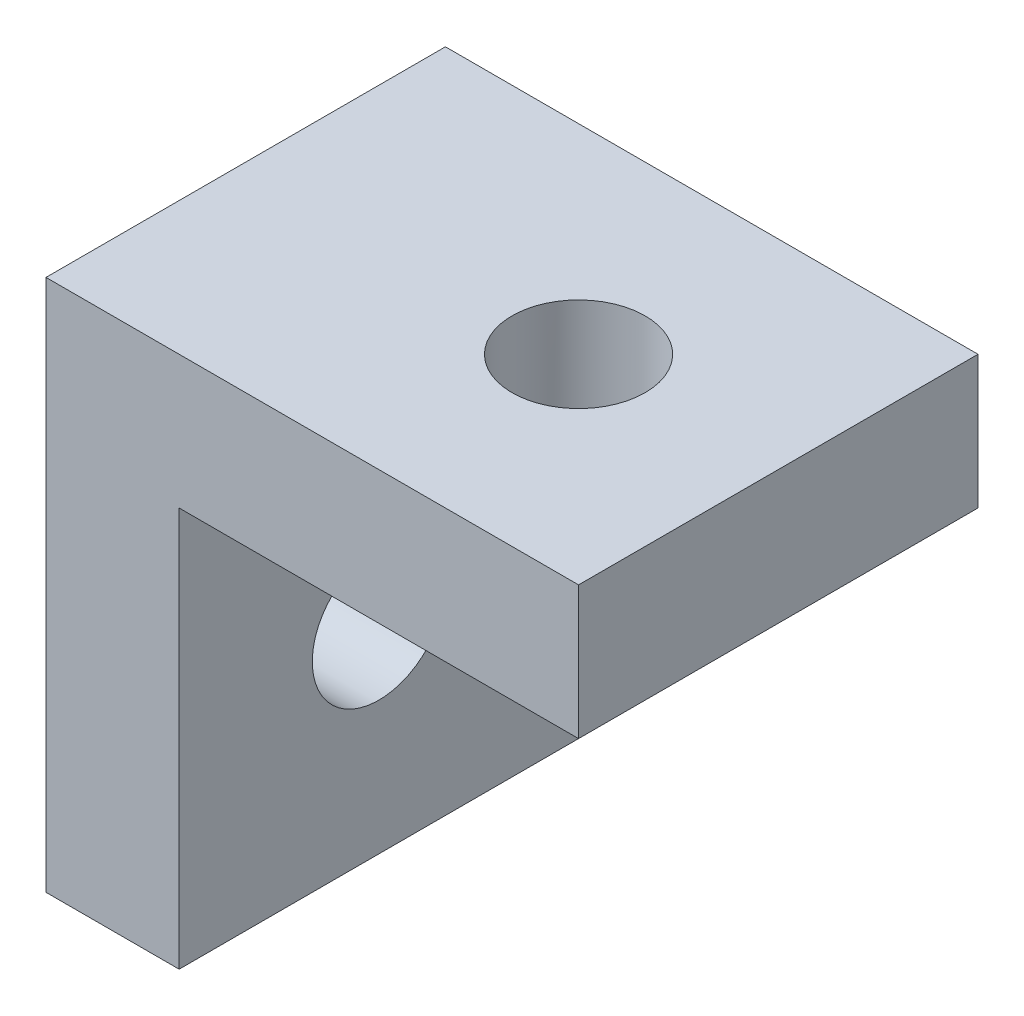
ISO-10303-21;
HEADER;
FILE_DESCRIPTION(('STEP AP214'),'2;1');
FILE_NAME('part.step','',(''),(''),'','','');
FILE_SCHEMA(('AUTOMOTIVE_DESIGN { 1 0 10303 214 1 1 1 1 }'));
ENDSEC;
DATA;
#1=APPLICATION_CONTEXT('core data for automotive mechanical design processes');
#2=APPLICATION_PROTOCOL_DEFINITION('international standard','automotive_design',2000,#1);
#3=PRODUCT_CONTEXT('',#1,'mechanical');
#4=PRODUCT('Part','Part','',(#3));
#5=PRODUCT_RELATED_PRODUCT_CATEGORY('part','',(#4));
#6=PRODUCT_DEFINITION_FORMATION('','',#4);
#7=PRODUCT_DEFINITION_CONTEXT('part definition',#1,'design');
#8=PRODUCT_DEFINITION('design','',#6,#7);
#9=PRODUCT_DEFINITION_SHAPE('','',#8);
#10=(LENGTH_UNIT() NAMED_UNIT(*) SI_UNIT(.MILLI.,.METRE.));
#11=(NAMED_UNIT(*) PLANE_ANGLE_UNIT() SI_UNIT($,.RADIAN.));
#12=(NAMED_UNIT(*) SI_UNIT($,.STERADIAN.) SOLID_ANGLE_UNIT());
#13=UNCERTAINTY_MEASURE_WITH_UNIT(LENGTH_MEASURE(1.E-05),#10,'distance_accuracy_value','');
#14=(GEOMETRIC_REPRESENTATION_CONTEXT(3) GLOBAL_UNCERTAINTY_ASSIGNED_CONTEXT((#13)) GLOBAL_UNIT_ASSIGNED_CONTEXT((#10,
#11,#12)) REPRESENTATION_CONTEXT('',''));
#15=CARTESIAN_POINT('',(0.,0.,0.));
#16=DIRECTION('',(0.,0.,1.));
#17=DIRECTION('',(1.,0.,0.));
#18=AXIS2_PLACEMENT_3D('',#15,#16,#17);
#19=CARTESIAN_POINT('',(0.,30.,30.));
#20=DIRECTION('',(0.,1.,0.));
#21=DIRECTION('',(-1.,0.,0.));
#22=AXIS2_PLACEMENT_3D('',#19,#20,#21);
#23=PLANE('',#22);
#24=CARTESIAN_POINT('',(15.,30.,15.));
#25=DIRECTION('',(0.,1.,0.));
#26=DIRECTION('',(-1.,0.,0.));
#27=AXIS2_PLACEMENT_3D('',#24,#25,#26);
#28=CIRCLE('',#27,5.00000000000001);
#29=CARTESIAN_POINT('',(9.99999999999999,30.,15.));
#30=VERTEX_POINT('',#29);
#31=EDGE_CURVE('E124',#30,#30,#28,.T.);
#32=ORIENTED_EDGE('',*,*,#31,.T.);
#33=EDGE_LOOP('',(#32));
#34=FACE_BOUND('',#33,.T.);
#35=DIRECTION('',(1.,0.,0.));
#36=VECTOR('',#35,1.);
#37=CARTESIAN_POINT('',(0.,30.,0.));
#38=LINE('',#37,#36);
#39=CARTESIAN_POINT('',(0.,30.,0.));
#40=VERTEX_POINT('',#39);
#41=CARTESIAN_POINT('',(30.,30.,0.));
#42=VERTEX_POINT('',#41);
#43=EDGE_CURVE('E120',#40,#42,#38,.T.);
#44=ORIENTED_EDGE('',*,*,#43,.T.);
#45=DIRECTION('',(0.,0.,-1.));
#46=VECTOR('',#45,1.);
#47=CARTESIAN_POINT('',(30.,30.,30.));
#48=LINE('',#47,#46);
#49=CARTESIAN_POINT('',(30.,30.,30.));
#50=VERTEX_POINT('',#49);
#51=EDGE_CURVE('E11',#50,#42,#48,.T.);
#52=ORIENTED_EDGE('',*,*,#51,.F.);
#53=DIRECTION('',(1.,0.,0.));
#54=VECTOR('',#53,1.);
#55=CARTESIAN_POINT('',(0.,30.,30.));
#56=LINE('',#55,#54);
#57=CARTESIAN_POINT('',(0.,30.,30.));
#58=VERTEX_POINT('',#57);
#59=EDGE_CURVE('E85',#58,#50,#56,.T.);
#60=ORIENTED_EDGE('',*,*,#59,.F.);
#61=DIRECTION('',(0.,0.,-1.));
#62=VECTOR('',#61,1.);
#63=CARTESIAN_POINT('',(0.,30.,30.));
#64=LINE('',#63,#62);
#65=EDGE_CURVE('E116',#58,#40,#64,.T.);
#66=ORIENTED_EDGE('',*,*,#65,.T.);
#67=EDGE_LOOP('',(#44,#52,#60,#66));
#68=FACE_BOUND('',#67,.T.);
#69=ADVANCED_FACE('F39',(#34,#68),#23,.F.);
#70=CARTESIAN_POINT('',(30.,40.,30.));
#71=DIRECTION('',(1.,0.,0.));
#72=DIRECTION('',(0.,1.,0.));
#73=AXIS2_PLACEMENT_3D('',#70,#71,#72);
#74=PLANE('',#73);
#75=DIRECTION('',(0.,-1.,0.));
#76=VECTOR('',#75,1.);
#77=CARTESIAN_POINT('',(30.,40.,0.));
#78=LINE('',#77,#76);
#79=CARTESIAN_POINT('',(30.,40.,0.));
#80=VERTEX_POINT('',#79);
#81=EDGE_CURVE('E123',#80,#42,#78,.T.);
#82=ORIENTED_EDGE('',*,*,#81,.F.);
#83=DIRECTION('',(0.,0.,-1.));
#84=VECTOR('',#83,1.);
#85=CARTESIAN_POINT('',(30.,40.,30.));
#86=LINE('',#85,#84);
#87=CARTESIAN_POINT('',(30.,40.,30.));
#88=VERTEX_POINT('',#87);
#89=EDGE_CURVE('E47',#88,#80,#86,.T.);
#90=ORIENTED_EDGE('',*,*,#89,.F.);
#91=DIRECTION('',(0.,-1.,0.));
#92=VECTOR('',#91,1.);
#93=CARTESIAN_POINT('',(30.,40.,30.));
#94=LINE('',#93,#92);
#95=EDGE_CURVE('E175',#88,#50,#94,.T.);
#96=ORIENTED_EDGE('',*,*,#95,.T.);
#97=ORIENTED_EDGE('',*,*,#51,.T.);
#98=EDGE_LOOP('',(#82,#90,#96,#97));
#99=FACE_BOUND('',#98,.T.);
#100=ADVANCED_FACE('F142',(#99),#74,.T.);
#101=CARTESIAN_POINT('',(0.,40.,30.));
#102=DIRECTION('',(0.,1.,0.));
#103=DIRECTION('',(-1.,0.,0.));
#104=AXIS2_PLACEMENT_3D('',#101,#102,#103);
#105=PLANE('',#104);
#106=CARTESIAN_POINT('',(15.,40.,15.));
#107=DIRECTION('',(0.,-1.,0.));
#108=DIRECTION('',(1.,0.,0.));
#109=AXIS2_PLACEMENT_3D('',#106,#107,#108);
#110=CIRCLE('',#109,5.00000000000001);
#111=CARTESIAN_POINT('',(20.,40.,15.));
#112=VERTEX_POINT('',#111);
#113=EDGE_CURVE('E167',#112,#112,#110,.T.);
#114=ORIENTED_EDGE('',*,*,#113,.T.);
#115=EDGE_LOOP('',(#114));
#116=FACE_BOUND('',#115,.T.);
#117=DIRECTION('',(1.,0.,0.));
#118=VECTOR('',#117,1.);
#119=CARTESIAN_POINT('',(0.,40.,0.));
#120=LINE('',#119,#118);
#121=CARTESIAN_POINT('',(-10.,40.,0.));
#122=VERTEX_POINT('',#121);
#123=EDGE_CURVE('E127',#122,#80,#120,.T.);
#124=ORIENTED_EDGE('',*,*,#123,.F.);
#125=DIRECTION('',(0.,0.,-1.));
#126=VECTOR('',#125,1.);
#127=CARTESIAN_POINT('',(-10.,40.,30.));
#128=LINE('',#127,#126);
#129=CARTESIAN_POINT('',(-10.,40.,30.));
#130=VERTEX_POINT('',#129);
#131=EDGE_CURVE('E106',#130,#122,#128,.T.);
#132=ORIENTED_EDGE('',*,*,#131,.F.);
#133=DIRECTION('',(1.,0.,0.));
#134=VECTOR('',#133,1.);
#135=CARTESIAN_POINT('',(0.,40.,30.));
#136=LINE('',#135,#134);
#137=EDGE_CURVE('E112',#130,#88,#136,.T.);
#138=ORIENTED_EDGE('',*,*,#137,.T.);
#139=ORIENTED_EDGE('',*,*,#89,.T.);
#140=EDGE_LOOP('',(#124,#132,#138,#139));
#141=FACE_BOUND('',#140,.T.);
#142=ADVANCED_FACE('F139',(#116,#141),#105,.T.);
#143=CARTESIAN_POINT('',(-10.,0.,30.));
#144=DIRECTION('',(-1.,0.,0.));
#145=DIRECTION('',(0.,0.,1.));
#146=AXIS2_PLACEMENT_3D('',#143,#144,#145);
#147=PLANE('',#146);
#148=CARTESIAN_POINT('',(-10.,15.,15.));
#149=DIRECTION('',(1.,0.,0.));
#150=DIRECTION('',(0.,0.,-1.));
#151=AXIS2_PLACEMENT_3D('',#148,#149,#150);
#152=CIRCLE('',#151,5.);
#153=CARTESIAN_POINT('',(-10.,15.,10.));
#154=VERTEX_POINT('',#153);
#155=EDGE_CURVE('E170',#154,#154,#152,.T.);
#156=ORIENTED_EDGE('',*,*,#155,.T.);
#157=EDGE_LOOP('',(#156));
#158=FACE_BOUND('',#157,.T.);
#159=DIRECTION('',(0.,1.,0.));
#160=VECTOR('',#159,1.);
#161=CARTESIAN_POINT('',(-10.,0.,0.));
#162=LINE('',#161,#160);
#163=CARTESIAN_POINT('',(-10.,0.,0.));
#164=VERTEX_POINT('',#163);
#165=EDGE_CURVE('E101',#164,#122,#162,.T.);
#166=ORIENTED_EDGE('',*,*,#165,.F.);
#167=DIRECTION('',(0.,0.,-1.));
#168=VECTOR('',#167,1.);
#169=CARTESIAN_POINT('',(-10.,0.,30.));
#170=LINE('',#169,#168);
#171=CARTESIAN_POINT('',(-10.,0.,30.));
#172=VERTEX_POINT('',#171);
#173=EDGE_CURVE('E96',#172,#164,#170,.T.);
#174=ORIENTED_EDGE('',*,*,#173,.F.);
#175=DIRECTION('',(0.,1.,0.));
#176=VECTOR('',#175,1.);
#177=CARTESIAN_POINT('',(-10.,0.,30.));
#178=LINE('',#177,#176);
#179=EDGE_CURVE('E99',#172,#130,#178,.T.);
#180=ORIENTED_EDGE('',*,*,#179,.T.);
#181=ORIENTED_EDGE('',*,*,#131,.T.);
#182=EDGE_LOOP('',(#166,#174,#180,#181));
#183=FACE_BOUND('',#182,.T.);
#184=ADVANCED_FACE('F98',(#158,#183),#147,.T.);
#185=CARTESIAN_POINT('',(0.,0.,30.));
#186=DIRECTION('',(0.,-1.,0.));
#187=DIRECTION('',(0.,0.,-1.));
#188=AXIS2_PLACEMENT_3D('',#185,#186,#187);
#189=PLANE('',#188);
#190=DIRECTION('',(-1.,0.,0.));
#191=VECTOR('',#190,1.);
#192=CARTESIAN_POINT('',(0.,0.,0.));
#193=LINE('',#192,#191);
#194=CARTESIAN_POINT('',(0.,0.,0.));
#195=VERTEX_POINT('',#194);
#196=EDGE_CURVE('E131',#195,#164,#193,.T.);
#197=ORIENTED_EDGE('',*,*,#196,.F.);
#198=DIRECTION('',(0.,0.,-1.));
#199=VECTOR('',#198,1.);
#200=CARTESIAN_POINT('',(0.,0.,30.));
#201=LINE('',#200,#199);
#202=CARTESIAN_POINT('',(0.,0.,30.));
#203=VERTEX_POINT('',#202);
#204=EDGE_CURVE('E76',#203,#195,#201,.T.);
#205=ORIENTED_EDGE('',*,*,#204,.F.);
#206=DIRECTION('',(-1.,0.,0.));
#207=VECTOR('',#206,1.);
#208=CARTESIAN_POINT('',(0.,0.,30.));
#209=LINE('',#208,#207);
#210=EDGE_CURVE('E110',#203,#172,#209,.T.);
#211=ORIENTED_EDGE('',*,*,#210,.T.);
#212=ORIENTED_EDGE('',*,*,#173,.T.);
#213=EDGE_LOOP('',(#197,#205,#211,#212));
#214=FACE_BOUND('',#213,.T.);
#215=ADVANCED_FACE('F114',(#214),#189,.T.);
#216=CARTESIAN_POINT('',(0.,0.,30.));
#217=DIRECTION('',(-1.,0.,0.));
#218=DIRECTION('',(0.,0.,1.));
#219=AXIS2_PLACEMENT_3D('',#216,#217,#218);
#220=PLANE('',#219);
#221=CARTESIAN_POINT('',(0.,15.,15.));
#222=DIRECTION('',(1.,0.,0.));
#223=DIRECTION('',(0.,0.,-1.));
#224=AXIS2_PLACEMENT_3D('',#221,#222,#223);
#225=CIRCLE('',#224,5.);
#226=CARTESIAN_POINT('',(0.,15.,10.));
#227=VERTEX_POINT('',#226);
#228=EDGE_CURVE('E176',#227,#227,#225,.T.);
#229=ORIENTED_EDGE('',*,*,#228,.F.);
#230=EDGE_LOOP('',(#229));
#231=FACE_BOUND('',#230,.T.);
#232=DIRECTION('',(0.,1.,0.));
#233=VECTOR('',#232,1.);
#234=CARTESIAN_POINT('',(0.,0.,0.));
#235=LINE('',#234,#233);
#236=EDGE_CURVE('E79',#195,#40,#235,.T.);
#237=ORIENTED_EDGE('',*,*,#236,.T.);
#238=ORIENTED_EDGE('',*,*,#65,.F.);
#239=DIRECTION('',(0.,1.,0.));
#240=VECTOR('',#239,1.);
#241=CARTESIAN_POINT('',(0.,0.,30.));
#242=LINE('',#241,#240);
#243=EDGE_CURVE('E55',#203,#58,#242,.T.);
#244=ORIENTED_EDGE('',*,*,#243,.F.);
#245=ORIENTED_EDGE('',*,*,#204,.T.);
#246=EDGE_LOOP('',(#237,#238,#244,#245));
#247=FACE_BOUND('',#246,.T.);
#248=ADVANCED_FACE('F147',(#231,#247),#220,.F.);
#249=CARTESIAN_POINT('',(0.,0.,30.));
#250=DIRECTION('',(0.,0.,-1.));
#251=DIRECTION('',(-1.,0.,0.));
#252=AXIS2_PLACEMENT_3D('',#249,#250,#251);
#253=PLANE('',#252);
#254=ORIENTED_EDGE('',*,*,#59,.T.);
#255=ORIENTED_EDGE('',*,*,#95,.F.);
#256=ORIENTED_EDGE('',*,*,#137,.F.);
#257=ORIENTED_EDGE('',*,*,#179,.F.);
#258=ORIENTED_EDGE('',*,*,#210,.F.);
#259=ORIENTED_EDGE('',*,*,#243,.T.);
#260=EDGE_LOOP('',(#254,#255,#256,#257,#258,#259));
#261=FACE_BOUND('',#260,.T.);
#262=ADVANCED_FACE('F109',(#261),#253,.F.);
#263=CARTESIAN_POINT('',(0.,0.,0.));
#264=DIRECTION('',(0.,0.,-1.));
#265=DIRECTION('',(-1.,0.,0.));
#266=AXIS2_PLACEMENT_3D('',#263,#264,#265);
#267=PLANE('',#266);
#268=ORIENTED_EDGE('',*,*,#43,.F.);
#269=ORIENTED_EDGE('',*,*,#236,.F.);
#270=ORIENTED_EDGE('',*,*,#196,.T.);
#271=ORIENTED_EDGE('',*,*,#165,.T.);
#272=ORIENTED_EDGE('',*,*,#123,.T.);
#273=ORIENTED_EDGE('',*,*,#81,.T.);
#274=EDGE_LOOP('',(#268,#269,#270,#271,#272,#273));
#275=FACE_BOUND('',#274,.T.);
#276=ADVANCED_FACE('F145',(#275),#267,.T.);
#277=CARTESIAN_POINT('',(15.,40.,15.));
#278=DIRECTION('',(0.,-1.,0.));
#279=DIRECTION('',(1.,0.,0.));
#280=AXIS2_PLACEMENT_3D('',#277,#278,#279);
#281=CYLINDRICAL_SURFACE('',#280,5.00000000000001);
#282=ORIENTED_EDGE('',*,*,#113,.F.);
#283=EDGE_LOOP('',(#282));
#284=FACE_BOUND('',#283,.T.);
#285=ORIENTED_EDGE('',*,*,#31,.F.);
#286=EDGE_LOOP('',(#285));
#287=FACE_BOUND('',#286,.T.);
#288=ADVANCED_FACE('F186',(#284,#287),#281,.F.);
#289=CARTESIAN_POINT('',(-10.,15.,15.));
#290=DIRECTION('',(1.,0.,0.));
#291=DIRECTION('',(0.,0.,-1.));
#292=AXIS2_PLACEMENT_3D('',#289,#290,#291);
#293=CYLINDRICAL_SURFACE('',#292,5.);
#294=ORIENTED_EDGE('',*,*,#155,.F.);
#295=EDGE_LOOP('',(#294));
#296=FACE_BOUND('',#295,.T.);
#297=ORIENTED_EDGE('',*,*,#228,.T.);
#298=EDGE_LOOP('',(#297));
#299=FACE_BOUND('',#298,.T.);
#300=ADVANCED_FACE('F183',(#296,#299),#293,.F.);
#301=CLOSED_SHELL('',(#69,#100,#142,#184,#215,#248,#262,#276,#288,#300));
#302=MANIFOLD_SOLID_BREP('B2',#301);
#303=ADVANCED_BREP_SHAPE_REPRESENTATION('',(#18,#302),#14);
#304=SHAPE_DEFINITION_REPRESENTATION(#9,#303);
ENDSEC;
END-ISO-10303-21;
